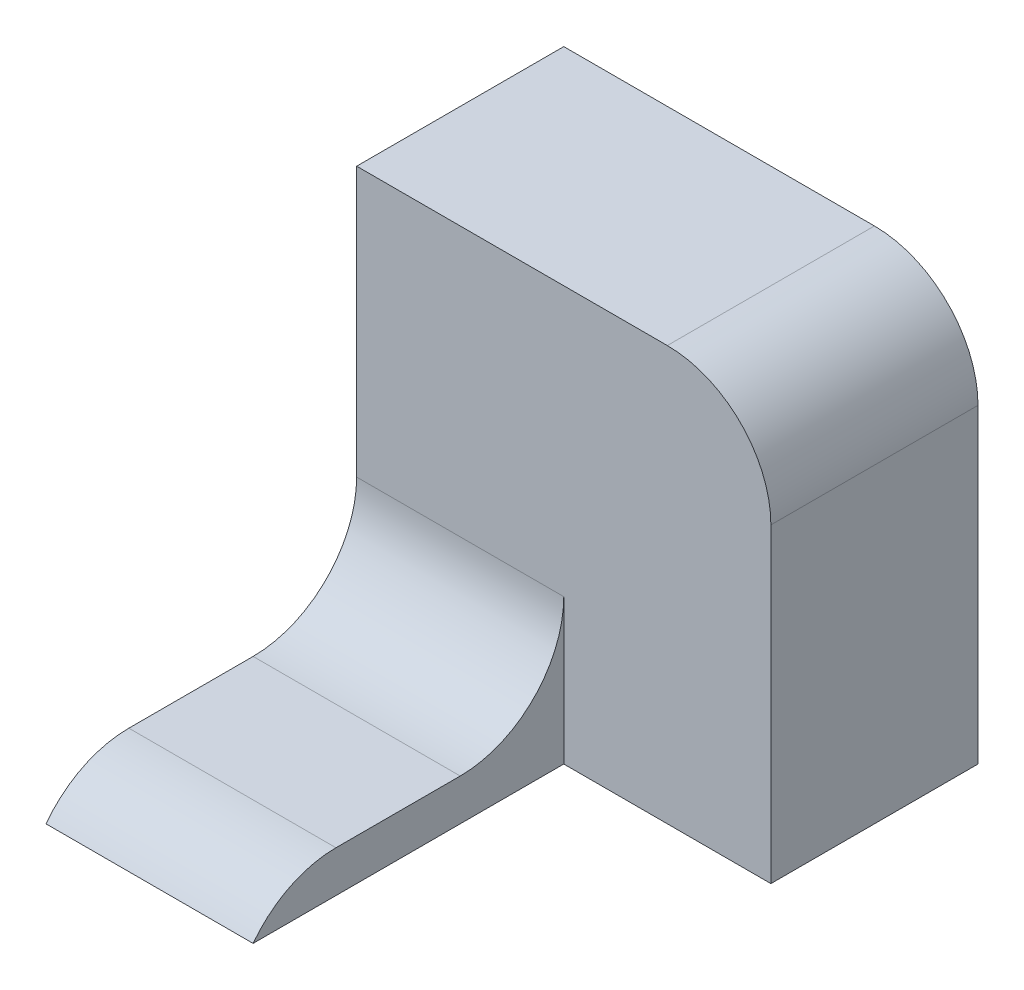
ISO-10303-21;
HEADER;
FILE_DESCRIPTION(('STEP AP214'),'2;1');
FILE_NAME('part.step','',(''),(''),'','','');
FILE_SCHEMA(('AUTOMOTIVE_DESIGN { 1 0 10303 214 1 1 1 1 }'));
ENDSEC;
DATA;
#1=APPLICATION_CONTEXT('core data for automotive mechanical design processes');
#2=APPLICATION_PROTOCOL_DEFINITION('international standard','automotive_design',2000,#1);
#3=PRODUCT_CONTEXT('',#1,'mechanical');
#4=PRODUCT('Part','Part','',(#3));
#5=PRODUCT_RELATED_PRODUCT_CATEGORY('part','',(#4));
#6=PRODUCT_DEFINITION_FORMATION('','',#4);
#7=PRODUCT_DEFINITION_CONTEXT('part definition',#1,'design');
#8=PRODUCT_DEFINITION('design','',#6,#7);
#9=PRODUCT_DEFINITION_SHAPE('','',#8);
#10=(LENGTH_UNIT() NAMED_UNIT(*) SI_UNIT(.MILLI.,.METRE.));
#11=(NAMED_UNIT(*) PLANE_ANGLE_UNIT() SI_UNIT($,.RADIAN.));
#12=(NAMED_UNIT(*) SI_UNIT($,.STERADIAN.) SOLID_ANGLE_UNIT());
#13=UNCERTAINTY_MEASURE_WITH_UNIT(LENGTH_MEASURE(1.E-05),#10,'distance_accuracy_value','');
#14=(GEOMETRIC_REPRESENTATION_CONTEXT(3) GLOBAL_UNCERTAINTY_ASSIGNED_CONTEXT((#13)) GLOBAL_UNIT_ASSIGNED_CONTEXT((#10,
#11,#12)) REPRESENTATION_CONTEXT('',''));
#15=CARTESIAN_POINT('',(0.,0.,0.));
#16=DIRECTION('',(0.,0.,1.));
#17=DIRECTION('',(1.,0.,0.));
#18=AXIS2_PLACEMENT_3D('',#15,#16,#17);
#19=CARTESIAN_POINT('',(-10.,0.,30.));
#20=DIRECTION('',(0.,-1.,0.));
#21=DIRECTION('',(1.,0.,0.));
#22=AXIS2_PLACEMENT_3D('',#19,#20,#21);
#23=PLANE('',#22);
#24=DIRECTION('',(0.,0.,-1.));
#25=VECTOR('',#24,1.);
#26=CARTESIAN_POINT('',(-10.,0.,30.));
#27=LINE('',#26,#25);
#28=CARTESIAN_POINT('',(-10.,0.,22.));
#29=VERTEX_POINT('',#28);
#30=CARTESIAN_POINT('',(-10.,0.,10.));
#31=VERTEX_POINT('',#30);
#32=EDGE_CURVE('E144',#29,#31,#27,.T.);
#33=ORIENTED_EDGE('',*,*,#32,.T.);
#34=DIRECTION('',(-1.,0.,0.));
#35=VECTOR('',#34,1.);
#36=CARTESIAN_POINT('',(-10.,0.,10.));
#37=LINE('',#36,#35);
#38=CARTESIAN_POINT('',(-30.,0.,10.));
#39=VERTEX_POINT('',#38);
#40=EDGE_CURVE('E158',#31,#39,#37,.T.);
#41=ORIENTED_EDGE('',*,*,#40,.T.);
#42=DIRECTION('',(0.,0.,-1.));
#43=VECTOR('',#42,1.);
#44=CARTESIAN_POINT('',(-30.,0.,30.));
#45=LINE('',#44,#43);
#46=CARTESIAN_POINT('',(-30.,0.,22.));
#47=VERTEX_POINT('',#46);
#48=EDGE_CURVE('E153',#47,#39,#45,.T.);
#49=ORIENTED_EDGE('',*,*,#48,.F.);
#50=DIRECTION('',(-1.,0.,0.));
#51=VECTOR('',#50,1.);
#52=CARTESIAN_POINT('',(-10.,0.,22.));
#53=LINE('',#52,#51);
#54=EDGE_CURVE('E156',#47,#29,#53,.F.);
#55=ORIENTED_EDGE('',*,*,#54,.T.);
#56=EDGE_LOOP('',(#33,#41,#49,#55));
#57=FACE_BOUND('',#56,.T.);
#58=ADVANCED_FACE('F35',(#57),#23,.F.);
#59=CARTESIAN_POINT('',(-30.,0.,30.));
#60=DIRECTION('',(1.,0.,0.));
#61=DIRECTION('',(0.,0.,-1.));
#62=AXIS2_PLACEMENT_3D('',#59,#60,#61);
#63=PLANE('',#62);
#64=DIRECTION('',(0.,0.,-1.));
#65=VECTOR('',#64,1.);
#66=CARTESIAN_POINT('',(-30.,-4.,30.));
#67=LINE('',#66,#65);
#68=CARTESIAN_POINT('',(-30.,-4.,30.));
#69=VERTEX_POINT('',#68);
#70=CARTESIAN_POINT('',(-30.,-4.,-20.));
#71=VERTEX_POINT('',#70);
#72=EDGE_CURVE('E151',#69,#71,#67,.T.);
#73=ORIENTED_EDGE('',*,*,#72,.F.);
#74=CARTESIAN_POINT('',(-30.,-10.,22.));
#75=DIRECTION('',(1.,0.,0.));
#76=DIRECTION('',(0.,0.,-1.));
#77=AXIS2_PLACEMENT_3D('',#74,#75,#76);
#78=CIRCLE('',#77,10.);
#79=EDGE_CURVE('E171',#69,#47,#78,.F.);
#80=ORIENTED_EDGE('',*,*,#79,.T.);
#81=ORIENTED_EDGE('',*,*,#48,.T.);
#82=CARTESIAN_POINT('',(-30.,10.,10.));
#83=DIRECTION('',(1.,0.,0.));
#84=DIRECTION('',(0.,0.,-1.));
#85=AXIS2_PLACEMENT_3D('',#82,#83,#84);
#86=CIRCLE('',#85,10.);
#87=CARTESIAN_POINT('',(-30.,10.,0.));
#88=VERTEX_POINT('',#87);
#89=EDGE_CURVE('E43',#39,#88,#86,.T.);
#90=ORIENTED_EDGE('',*,*,#89,.T.);
#91=DIRECTION('',(0.,-1.,0.));
#92=VECTOR('',#91,1.);
#93=CARTESIAN_POINT('',(-30.,36.,0.));
#94=LINE('',#93,#92);
#95=CARTESIAN_POINT('',(-30.,36.,0.));
#96=VERTEX_POINT('',#95);
#97=EDGE_CURVE('E119',#96,#88,#94,.T.);
#98=ORIENTED_EDGE('',*,*,#97,.F.);
#99=DIRECTION('',(0.,0.,1.));
#100=VECTOR('',#99,1.);
#101=CARTESIAN_POINT('',(-30.,36.,-20.));
#102=LINE('',#101,#100);
#103=CARTESIAN_POINT('',(-30.,36.,-20.));
#104=VERTEX_POINT('',#103);
#105=EDGE_CURVE('E108',#104,#96,#102,.T.);
#106=ORIENTED_EDGE('',*,*,#105,.F.);
#107=DIRECTION('',(0.,-1.,0.));
#108=VECTOR('',#107,1.);
#109=CARTESIAN_POINT('',(-30.,36.,-20.));
#110=LINE('',#109,#108);
#111=EDGE_CURVE('E111',#104,#71,#110,.T.);
#112=ORIENTED_EDGE('',*,*,#111,.T.);
#113=EDGE_LOOP('',(#73,#80,#81,#90,#98,#106,#112));
#114=FACE_BOUND('',#113,.T.);
#115=ADVANCED_FACE('F117',(#114),#63,.F.);
#116=CARTESIAN_POINT('',(-30.,-4.,30.));
#117=DIRECTION('',(0.,1.,0.));
#118=DIRECTION('',(0.,0.,1.));
#119=AXIS2_PLACEMENT_3D('',#116,#117,#118);
#120=PLANE('',#119);
#121=ORIENTED_EDGE('',*,*,#72,.T.);
#122=DIRECTION('',(1.,0.,0.));
#123=VECTOR('',#122,1.);
#124=CARTESIAN_POINT('',(-30.,-4.,-20.));
#125=LINE('',#124,#123);
#126=CARTESIAN_POINT('',(10.,-4.,-20.));
#127=VERTEX_POINT('',#126);
#128=EDGE_CURVE('E126',#71,#127,#125,.T.);
#129=ORIENTED_EDGE('',*,*,#128,.T.);
#130=DIRECTION('',(0.,0.,1.));
#131=VECTOR('',#130,1.);
#132=CARTESIAN_POINT('',(10.,-4.,-20.));
#133=LINE('',#132,#131);
#134=CARTESIAN_POINT('',(10.,-4.,0.));
#135=VERTEX_POINT('',#134);
#136=EDGE_CURVE('E120',#127,#135,#133,.T.);
#137=ORIENTED_EDGE('',*,*,#136,.T.);
#138=DIRECTION('',(1.,0.,0.));
#139=VECTOR('',#138,1.);
#140=CARTESIAN_POINT('',(-30.,-4.,0.));
#141=LINE('',#140,#139);
#142=CARTESIAN_POINT('',(-10.,-4.,0.));
#143=VERTEX_POINT('',#142);
#144=EDGE_CURVE('E134',#143,#135,#141,.T.);
#145=ORIENTED_EDGE('',*,*,#144,.F.);
#146=DIRECTION('',(0.,0.,-1.));
#147=VECTOR('',#146,1.);
#148=CARTESIAN_POINT('',(-10.,-4.,30.));
#149=LINE('',#148,#147);
#150=CARTESIAN_POINT('',(-10.,-4.,30.));
#151=VERTEX_POINT('',#150);
#152=EDGE_CURVE('E148',#151,#143,#149,.T.);
#153=ORIENTED_EDGE('',*,*,#152,.F.);
#154=DIRECTION('',(1.,0.,0.));
#155=VECTOR('',#154,1.);
#156=CARTESIAN_POINT('',(-30.,-4.,30.));
#157=LINE('',#156,#155);
#158=EDGE_CURVE('E141',#69,#151,#157,.T.);
#159=ORIENTED_EDGE('',*,*,#158,.F.);
#160=EDGE_LOOP('',(#121,#129,#137,#145,#153,#159));
#161=FACE_BOUND('',#160,.T.);
#162=ADVANCED_FACE('F193',(#161),#120,.F.);
#163=CARTESIAN_POINT('',(-10.,-4.,30.));
#164=DIRECTION('',(-1.,0.,0.));
#165=DIRECTION('',(0.,0.,1.));
#166=AXIS2_PLACEMENT_3D('',#163,#164,#165);
#167=PLANE('',#166);
#168=ORIENTED_EDGE('',*,*,#32,.F.);
#169=CARTESIAN_POINT('',(-10.,-10.,22.));
#170=DIRECTION('',(-1.,0.,0.));
#171=DIRECTION('',(0.,0.,1.));
#172=AXIS2_PLACEMENT_3D('',#169,#170,#171);
#173=CIRCLE('',#172,10.);
#174=EDGE_CURVE('E173',#29,#151,#173,.F.);
#175=ORIENTED_EDGE('',*,*,#174,.T.);
#176=ORIENTED_EDGE('',*,*,#152,.T.);
#177=DIRECTION('',(0.,1.,0.));
#178=VECTOR('',#177,1.);
#179=CARTESIAN_POINT('',(-10.,-4.,0.));
#180=LINE('',#179,#178);
#181=CARTESIAN_POINT('',(-10.,10.,0.));
#182=VERTEX_POINT('',#181);
#183=EDGE_CURVE('E139',#143,#182,#180,.T.);
#184=ORIENTED_EDGE('',*,*,#183,.T.);
#185=CARTESIAN_POINT('',(-10.,10.,10.));
#186=DIRECTION('',(-1.,0.,0.));
#187=DIRECTION('',(0.,0.,1.));
#188=AXIS2_PLACEMENT_3D('',#185,#186,#187);
#189=CIRCLE('',#188,10.);
#190=EDGE_CURVE('E11',#182,#31,#189,.T.);
#191=ORIENTED_EDGE('',*,*,#190,.T.);
#192=EDGE_LOOP('',(#168,#175,#176,#184,#191));
#193=FACE_BOUND('',#192,.T.);
#194=ADVANCED_FACE('F184',(#193),#167,.F.);
#195=CARTESIAN_POINT('',(0.,0.,0.));
#196=DIRECTION('',(0.,0.,1.));
#197=DIRECTION('',(1.,0.,0.));
#198=AXIS2_PLACEMENT_3D('',#195,#196,#197);
#199=PLANE('',#198);
#200=ORIENTED_EDGE('',*,*,#97,.T.);
#201=DIRECTION('',(-1.,0.,0.));
#202=VECTOR('',#201,1.);
#203=CARTESIAN_POINT('',(0.,10.,0.));
#204=LINE('',#203,#202);
#205=EDGE_CURVE('E163',#88,#182,#204,.F.);
#206=ORIENTED_EDGE('',*,*,#205,.T.);
#207=ORIENTED_EDGE('',*,*,#183,.F.);
#208=ORIENTED_EDGE('',*,*,#144,.T.);
#209=DIRECTION('',(0.,1.,0.));
#210=VECTOR('',#209,1.);
#211=CARTESIAN_POINT('',(10.,-4.,0.));
#212=LINE('',#211,#210);
#213=CARTESIAN_POINT('',(10.,26.,0.));
#214=VERTEX_POINT('',#213);
#215=EDGE_CURVE('E112',#135,#214,#212,.T.);
#216=ORIENTED_EDGE('',*,*,#215,.T.);
#217=CARTESIAN_POINT('',(0.,26.,0.));
#218=DIRECTION('',(0.,0.,1.));
#219=DIRECTION('',(1.,0.,0.));
#220=AXIS2_PLACEMENT_3D('',#217,#218,#219);
#221=CIRCLE('',#220,10.);
#222=CARTESIAN_POINT('',(0.,36.,0.));
#223=VERTEX_POINT('',#222);
#224=EDGE_CURVE('E161',#214,#223,#221,.T.);
#225=ORIENTED_EDGE('',*,*,#224,.T.);
#226=DIRECTION('',(-1.,0.,0.));
#227=VECTOR('',#226,1.);
#228=CARTESIAN_POINT('',(10.,36.,0.));
#229=LINE('',#228,#227);
#230=EDGE_CURVE('E131',#223,#96,#229,.T.);
#231=ORIENTED_EDGE('',*,*,#230,.T.);
#232=EDGE_LOOP('',(#200,#206,#207,#208,#216,#225,#231));
#233=FACE_BOUND('',#232,.T.);
#234=ADVANCED_FACE('F179',(#233),#199,.T.);
#235=CARTESIAN_POINT('',(10.,36.,-20.));
#236=DIRECTION('',(0.,1.,0.));
#237=DIRECTION('',(0.,0.,1.));
#238=AXIS2_PLACEMENT_3D('',#235,#236,#237);
#239=PLANE('',#238);
#240=ORIENTED_EDGE('',*,*,#230,.F.);
#241=DIRECTION('',(0.,0.,1.));
#242=VECTOR('',#241,1.);
#243=CARTESIAN_POINT('',(0.,36.,-20.));
#244=LINE('',#243,#242);
#245=CARTESIAN_POINT('',(0.,36.,-20.));
#246=VERTEX_POINT('',#245);
#247=EDGE_CURVE('E50',#223,#246,#244,.F.);
#248=ORIENTED_EDGE('',*,*,#247,.T.);
#249=DIRECTION('',(-1.,0.,0.));
#250=VECTOR('',#249,1.);
#251=CARTESIAN_POINT('',(10.,36.,-20.));
#252=LINE('',#251,#250);
#253=EDGE_CURVE('E105',#246,#104,#252,.T.);
#254=ORIENTED_EDGE('',*,*,#253,.T.);
#255=ORIENTED_EDGE('',*,*,#105,.T.);
#256=EDGE_LOOP('',(#240,#248,#254,#255));
#257=FACE_BOUND('',#256,.T.);
#258=ADVANCED_FACE('F107',(#257),#239,.T.);
#259=CARTESIAN_POINT('',(10.,-4.,-20.));
#260=DIRECTION('',(1.,0.,0.));
#261=DIRECTION('',(0.,0.,-1.));
#262=AXIS2_PLACEMENT_3D('',#259,#260,#261);
#263=PLANE('',#262);
#264=DIRECTION('',(0.,1.,0.));
#265=VECTOR('',#264,1.);
#266=CARTESIAN_POINT('',(10.,-4.,-20.));
#267=LINE('',#266,#265);
#268=CARTESIAN_POINT('',(10.,26.,-20.));
#269=VERTEX_POINT('',#268);
#270=EDGE_CURVE('E121',#127,#269,#267,.T.);
#271=ORIENTED_EDGE('',*,*,#270,.T.);
#272=DIRECTION('',(0.,0.,1.));
#273=VECTOR('',#272,1.);
#274=CARTESIAN_POINT('',(10.,26.,-20.));
#275=LINE('',#274,#273);
#276=EDGE_CURVE('E166',#269,#214,#275,.T.);
#277=ORIENTED_EDGE('',*,*,#276,.T.);
#278=ORIENTED_EDGE('',*,*,#215,.F.);
#279=ORIENTED_EDGE('',*,*,#136,.F.);
#280=EDGE_LOOP('',(#271,#277,#278,#279));
#281=FACE_BOUND('',#280,.T.);
#282=ADVANCED_FACE('F196',(#281),#263,.T.);
#283=CARTESIAN_POINT('',(0.,0.,-20.));
#284=DIRECTION('',(0.,0.,1.));
#285=DIRECTION('',(1.,0.,0.));
#286=AXIS2_PLACEMENT_3D('',#283,#284,#285);
#287=PLANE('',#286);
#288=ORIENTED_EDGE('',*,*,#253,.F.);
#289=CARTESIAN_POINT('',(0.,26.,-20.));
#290=DIRECTION('',(0.,0.,1.));
#291=DIRECTION('',(1.,0.,0.));
#292=AXIS2_PLACEMENT_3D('',#289,#290,#291);
#293=CIRCLE('',#292,10.);
#294=EDGE_CURVE('E57',#246,#269,#293,.F.);
#295=ORIENTED_EDGE('',*,*,#294,.T.);
#296=ORIENTED_EDGE('',*,*,#270,.F.);
#297=ORIENTED_EDGE('',*,*,#128,.F.);
#298=ORIENTED_EDGE('',*,*,#111,.F.);
#299=EDGE_LOOP('',(#288,#295,#296,#297,#298));
#300=FACE_BOUND('',#299,.T.);
#301=ADVANCED_FACE('F124',(#300),#287,.F.);
#302=CARTESIAN_POINT('',(-10.,10.,10.));
#303=DIRECTION('',(-1.,0.,0.));
#304=DIRECTION('',(0.,-1.,0.));
#305=AXIS2_PLACEMENT_3D('',#302,#303,#304);
#306=CYLINDRICAL_SURFACE('',#305,10.);
#307=ORIENTED_EDGE('',*,*,#190,.F.);
#308=ORIENTED_EDGE('',*,*,#205,.F.);
#309=ORIENTED_EDGE('',*,*,#89,.F.);
#310=ORIENTED_EDGE('',*,*,#40,.F.);
#311=EDGE_LOOP('',(#307,#308,#309,#310));
#312=FACE_BOUND('',#311,.T.);
#313=ADVANCED_FACE('F181',(#312),#306,.F.);
#314=CARTESIAN_POINT('',(0.,26.,-20.));
#315=DIRECTION('',(0.,0.,1.));
#316=DIRECTION('',(1.,0.,0.));
#317=AXIS2_PLACEMENT_3D('',#314,#315,#316);
#318=CYLINDRICAL_SURFACE('',#317,10.);
#319=ORIENTED_EDGE('',*,*,#294,.F.);
#320=ORIENTED_EDGE('',*,*,#247,.F.);
#321=ORIENTED_EDGE('',*,*,#224,.F.);
#322=ORIENTED_EDGE('',*,*,#276,.F.);
#323=EDGE_LOOP('',(#319,#320,#321,#322));
#324=FACE_BOUND('',#323,.T.);
#325=ADVANCED_FACE('F199',(#324),#318,.T.);
#326=CARTESIAN_POINT('',(0.,-10.,22.));
#327=DIRECTION('',(-1.,0.,0.));
#328=DIRECTION('',(0.,0.,1.));
#329=AXIS2_PLACEMENT_3D('',#326,#327,#328);
#330=CYLINDRICAL_SURFACE('',#329,10.);
#331=ORIENTED_EDGE('',*,*,#174,.F.);
#332=ORIENTED_EDGE('',*,*,#54,.F.);
#333=ORIENTED_EDGE('',*,*,#79,.F.);
#334=ORIENTED_EDGE('',*,*,#158,.T.);
#335=EDGE_LOOP('',(#331,#332,#333,#334));
#336=FACE_BOUND('',#335,.T.);
#337=ADVANCED_FACE('F37',(#336),#330,.T.);
#338=CLOSED_SHELL('',(#58,#115,#162,#194,#234,#258,#282,#301,#313,#325,#337));
#339=MANIFOLD_SOLID_BREP('B2',#338);
#340=ADVANCED_BREP_SHAPE_REPRESENTATION('',(#18,#339),#14);
#341=SHAPE_DEFINITION_REPRESENTATION(#9,#340);
ENDSEC;
END-ISO-10303-21;
